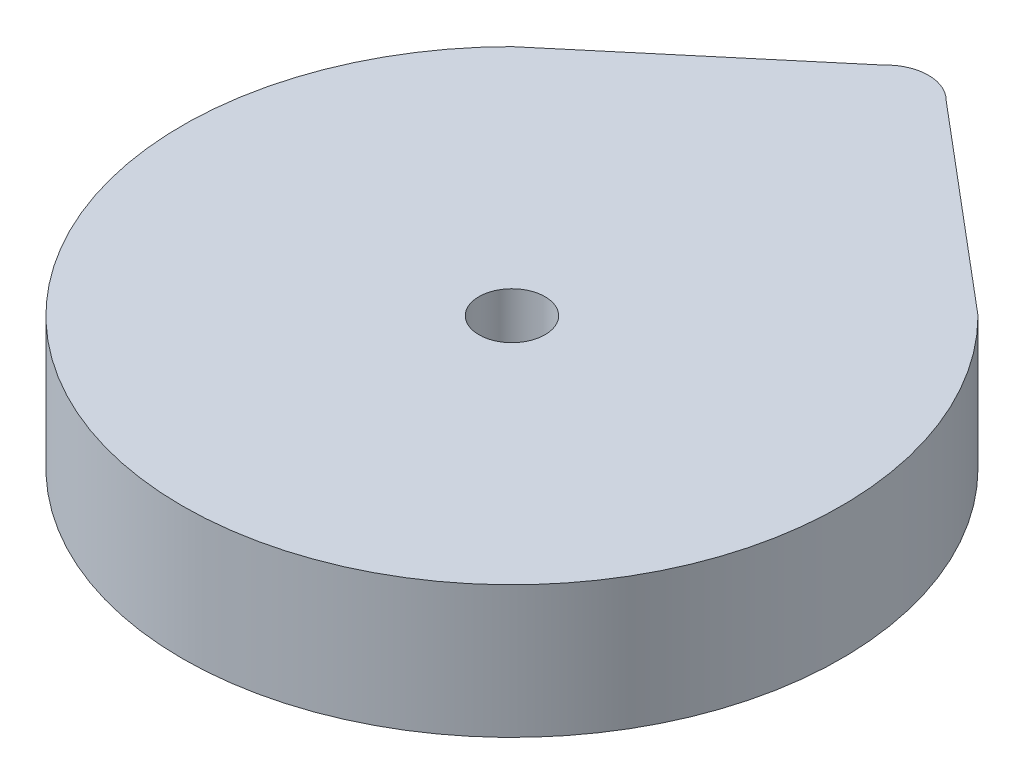
ISO-10303-21;
HEADER;
FILE_DESCRIPTION(('STEP AP214'),'2;1');
FILE_NAME('part.step','',(''),(''),'','','');
FILE_SCHEMA(('AUTOMOTIVE_DESIGN { 1 0 10303 214 1 1 1 1 }'));
ENDSEC;
DATA;
#1=APPLICATION_CONTEXT('core data for automotive mechanical design processes');
#2=APPLICATION_PROTOCOL_DEFINITION('international standard','automotive_design',2000,#1);
#3=PRODUCT_CONTEXT('',#1,'mechanical');
#4=PRODUCT('Part','Part','',(#3));
#5=PRODUCT_RELATED_PRODUCT_CATEGORY('part','',(#4));
#6=PRODUCT_DEFINITION_FORMATION('','',#4);
#7=PRODUCT_DEFINITION_CONTEXT('part definition',#1,'design');
#8=PRODUCT_DEFINITION('design','',#6,#7);
#9=PRODUCT_DEFINITION_SHAPE('','',#8);
#10=(LENGTH_UNIT() NAMED_UNIT(*) SI_UNIT(.MILLI.,.METRE.));
#11=(NAMED_UNIT(*) PLANE_ANGLE_UNIT() SI_UNIT($,.RADIAN.));
#12=(NAMED_UNIT(*) SI_UNIT($,.STERADIAN.) SOLID_ANGLE_UNIT());
#13=UNCERTAINTY_MEASURE_WITH_UNIT(LENGTH_MEASURE(1.E-05),#10,'distance_accuracy_value','');
#14=(GEOMETRIC_REPRESENTATION_CONTEXT(3) GLOBAL_UNCERTAINTY_ASSIGNED_CONTEXT((#13)) GLOBAL_UNIT_ASSIGNED_CONTEXT((#10,
#11,#12)) REPRESENTATION_CONTEXT('',''));
#15=CARTESIAN_POINT('',(0.,0.,0.));
#16=DIRECTION('',(0.,0.,1.));
#17=DIRECTION('',(1.,0.,0.));
#18=AXIS2_PLACEMENT_3D('',#15,#16,#17);
#19=CARTESIAN_POINT('',(0.,5.08,-14.3662420125912));
#20=DIRECTION('',(0.,1.,0.));
#21=DIRECTION('',(0.,0.,1.));
#22=AXIS2_PLACEMENT_3D('',#19,#20,#21);
#23=PLANE('',#22);
#24=DIRECTION('',(-0.764735589816638,0.,-0.644344222964557));
#25=VECTOR('',#24,1.);
#26=CARTESIAN_POINT('',(8.953988523824,5.08,-8.95398852382403));
#27=LINE('',#26,#25);
#28=CARTESIAN_POINT('',(8.95398852382399,5.08,-8.95398852382404));
#29=VERTEX_POINT('',#28);
#30=CARTESIAN_POINT('',(1.17354275739454,5.08,-15.5095684503316));
#31=VERTEX_POINT('',#30);
#32=EDGE_CURVE('E103',#29,#31,#27,.T.);
#33=ORIENTED_EDGE('',*,*,#32,.T.);
#34=CARTESIAN_POINT('',(0.,5.08,-14.3662420125912));
#35=DIRECTION('',(0.,1.,0.));
#36=DIRECTION('',(0.,0.,1.));
#37=AXIS2_PLACEMENT_3D('',#34,#35,#36);
#38=CIRCLE('',#37,1.63841324050719);
#39=CARTESIAN_POINT('',(-1.20832673642565,5.08,-15.4727430043251));
#40=VERTEX_POINT('',#39);
#41=EDGE_CURVE('E98',#31,#40,#38,.T.);
#42=ORIENTED_EDGE('',*,*,#41,.T.);
#43=DIRECTION('',(0.765101365427687,0.,-0.643909854421168));
#44=VECTOR('',#43,1.);
#45=CARTESIAN_POINT('',(-8.95398852382406,5.08,-8.95398852382397));
#46=LINE('',#45,#44);
#47=CARTESIAN_POINT('',(-8.95398852382406,5.08,-8.95398852382397));
#48=VERTEX_POINT('',#47);
#49=EDGE_CURVE('E101',#48,#40,#46,.T.);
#50=ORIENTED_EDGE('',*,*,#49,.F.);
#51=CARTESIAN_POINT('',(0.,5.08,0.));
#52=DIRECTION('',(0.,1.,0.));
#53=DIRECTION('',(0.,0.,1.));
#54=AXIS2_PLACEMENT_3D('',#51,#52,#53);
#55=CIRCLE('',#54,12.662852007725);
#56=EDGE_CURVE('E72',#48,#29,#55,.T.);
#57=ORIENTED_EDGE('',*,*,#56,.T.);
#58=EDGE_LOOP('',(#33,#42,#50,#57));
#59=FACE_BOUND('',#58,.T.);
#60=CARTESIAN_POINT('',(0.,5.08,0.));
#61=DIRECTION('',(0.,1.,0.));
#62=DIRECTION('',(0.,0.,1.));
#63=AXIS2_PLACEMENT_3D('',#60,#61,#62);
#64=CIRCLE('',#63,1.27);
#65=CARTESIAN_POINT('',(0.,5.08,1.27));
#66=VERTEX_POINT('',#65);
#67=EDGE_CURVE('E126',#66,#66,#64,.T.);
#68=ORIENTED_EDGE('',*,*,#67,.F.);
#69=EDGE_LOOP('',(#68));
#70=FACE_BOUND('',#69,.T.);
#71=ADVANCED_FACE('F54',(#59,#70),#23,.T.);
#72=CARTESIAN_POINT('',(0.,0.,-14.3662420125912));
#73=DIRECTION('',(0.,1.,0.));
#74=DIRECTION('',(0.,0.,1.));
#75=AXIS2_PLACEMENT_3D('',#72,#73,#74);
#76=PLANE('',#75);
#77=DIRECTION('',(-0.764735589816638,0.,-0.644344222964557));
#78=VECTOR('',#77,1.);
#79=CARTESIAN_POINT('',(8.953988523824,0.,-8.95398852382403));
#80=LINE('',#79,#78);
#81=CARTESIAN_POINT('',(8.95398852382399,0.,-8.95398852382404));
#82=VERTEX_POINT('',#81);
#83=CARTESIAN_POINT('',(1.17354275739454,0.,-15.5095684503316));
#84=VERTEX_POINT('',#83);
#85=EDGE_CURVE('E122',#82,#84,#80,.T.);
#86=ORIENTED_EDGE('',*,*,#85,.F.);
#87=CARTESIAN_POINT('',(0.,0.,0.));
#88=DIRECTION('',(0.,1.,0.));
#89=DIRECTION('',(0.,0.,1.));
#90=AXIS2_PLACEMENT_3D('',#87,#88,#89);
#91=CIRCLE('',#90,12.662852007725);
#92=CARTESIAN_POINT('',(-8.95398852382406,0.,-8.95398852382397));
#93=VERTEX_POINT('',#92);
#94=EDGE_CURVE('E91',#93,#82,#91,.T.);
#95=ORIENTED_EDGE('',*,*,#94,.F.);
#96=DIRECTION('',(0.765101365427687,0.,-0.643909854421168));
#97=VECTOR('',#96,1.);
#98=CARTESIAN_POINT('',(-8.95398852382406,0.,-8.95398852382397));
#99=LINE('',#98,#97);
#100=CARTESIAN_POINT('',(-1.20832673642565,0.,-15.4727430043251));
#101=VERTEX_POINT('',#100);
#102=EDGE_CURVE('E129',#93,#101,#99,.T.);
#103=ORIENTED_EDGE('',*,*,#102,.T.);
#104=CARTESIAN_POINT('',(0.,0.,-14.3662420125912));
#105=DIRECTION('',(0.,1.,0.));
#106=DIRECTION('',(0.,0.,1.));
#107=AXIS2_PLACEMENT_3D('',#104,#105,#106);
#108=CIRCLE('',#107,1.63841324050719);
#109=EDGE_CURVE('E109',#84,#101,#108,.T.);
#110=ORIENTED_EDGE('',*,*,#109,.F.);
#111=EDGE_LOOP('',(#86,#95,#103,#110));
#112=FACE_BOUND('',#111,.T.);
#113=CARTESIAN_POINT('',(0.,0.,0.));
#114=DIRECTION('',(0.,1.,0.));
#115=DIRECTION('',(0.,0.,1.));
#116=AXIS2_PLACEMENT_3D('',#113,#114,#115);
#117=CIRCLE('',#116,1.27);
#118=CARTESIAN_POINT('',(0.,0.,1.27));
#119=VERTEX_POINT('',#118);
#120=EDGE_CURVE('E146',#119,#119,#117,.T.);
#121=ORIENTED_EDGE('',*,*,#120,.T.);
#122=EDGE_LOOP('',(#121));
#123=FACE_BOUND('',#122,.T.);
#124=ADVANCED_FACE('F140',(#112,#123),#76,.F.);
#125=CARTESIAN_POINT('',(8.953988523824,5.08,-8.95398852382403));
#126=DIRECTION('',(-0.644344222964557,0.,0.764735589816638));
#127=DIRECTION('',(0.764735589816638,0.,0.644344222964557));
#128=AXIS2_PLACEMENT_3D('',#125,#126,#127);
#129=PLANE('',#128);
#130=ORIENTED_EDGE('',*,*,#85,.T.);
#131=DIRECTION('',(0.,-1.,0.));
#132=VECTOR('',#131,1.);
#133=CARTESIAN_POINT('',(1.17354275739454,5.08,-15.5095684503316));
#134=LINE('',#133,#132);
#135=EDGE_CURVE('E12',#31,#84,#134,.T.);
#136=ORIENTED_EDGE('',*,*,#135,.F.);
#137=ORIENTED_EDGE('',*,*,#32,.F.);
#138=DIRECTION('',(0.,-1.,0.));
#139=VECTOR('',#138,1.);
#140=CARTESIAN_POINT('',(8.95398852382399,5.08,-8.95398852382404));
#141=LINE('',#140,#139);
#142=EDGE_CURVE('E118',#29,#82,#141,.T.);
#143=ORIENTED_EDGE('',*,*,#142,.T.);
#144=EDGE_LOOP('',(#130,#136,#137,#143));
#145=FACE_BOUND('',#144,.T.);
#146=ADVANCED_FACE('F56',(#145),#129,.F.);
#147=CARTESIAN_POINT('',(0.,5.08,-14.3662420125912));
#148=DIRECTION('',(0.,-1.,0.));
#149=DIRECTION('',(0.,0.,-1.));
#150=AXIS2_PLACEMENT_3D('',#147,#148,#149);
#151=CYLINDRICAL_SURFACE('',#150,1.63841324050719);
#152=ORIENTED_EDGE('',*,*,#109,.T.);
#153=DIRECTION('',(0.,-1.,0.));
#154=VECTOR('',#153,1.);
#155=CARTESIAN_POINT('',(-1.20832673642565,5.08,-15.4727430043251));
#156=LINE('',#155,#154);
#157=EDGE_CURVE('E64',#40,#101,#156,.T.);
#158=ORIENTED_EDGE('',*,*,#157,.F.);
#159=ORIENTED_EDGE('',*,*,#41,.F.);
#160=ORIENTED_EDGE('',*,*,#135,.T.);
#161=EDGE_LOOP('',(#152,#158,#159,#160));
#162=FACE_BOUND('',#161,.T.);
#163=ADVANCED_FACE('F108',(#162),#151,.T.);
#164=CARTESIAN_POINT('',(-8.95398852382406,5.08,-8.95398852382397));
#165=DIRECTION('',(-0.643909854421167,0.,-0.765101365427687));
#166=DIRECTION('',(-0.765101365427687,0.,0.643909854421167));
#167=AXIS2_PLACEMENT_3D('',#164,#165,#166);
#168=PLANE('',#167);
#169=ORIENTED_EDGE('',*,*,#102,.F.);
#170=DIRECTION('',(0.,-1.,0.));
#171=VECTOR('',#170,1.);
#172=CARTESIAN_POINT('',(-8.95398852382406,5.08,-8.95398852382397));
#173=LINE('',#172,#171);
#174=EDGE_CURVE('E88',#48,#93,#173,.T.);
#175=ORIENTED_EDGE('',*,*,#174,.F.);
#176=ORIENTED_EDGE('',*,*,#49,.T.);
#177=ORIENTED_EDGE('',*,*,#157,.T.);
#178=EDGE_LOOP('',(#169,#175,#176,#177));
#179=FACE_BOUND('',#178,.T.);
#180=ADVANCED_FACE('F114',(#179),#168,.T.);
#181=CARTESIAN_POINT('',(0.,5.08,0.));
#182=DIRECTION('',(0.,-1.,0.));
#183=DIRECTION('',(0.,0.,-1.));
#184=AXIS2_PLACEMENT_3D('',#181,#182,#183);
#185=CYLINDRICAL_SURFACE('',#184,12.662852007725);
#186=ORIENTED_EDGE('',*,*,#94,.T.);
#187=ORIENTED_EDGE('',*,*,#142,.F.);
#188=ORIENTED_EDGE('',*,*,#56,.F.);
#189=ORIENTED_EDGE('',*,*,#174,.T.);
#190=EDGE_LOOP('',(#186,#187,#188,#189));
#191=FACE_BOUND('',#190,.T.);
#192=ADVANCED_FACE('F163',(#191),#185,.T.);
#193=CARTESIAN_POINT('',(0.,5.08,0.));
#194=DIRECTION('',(0.,-1.,0.));
#195=DIRECTION('',(0.,0.,-1.));
#196=AXIS2_PLACEMENT_3D('',#193,#194,#195);
#197=CYLINDRICAL_SURFACE('',#196,1.27);
#198=ORIENTED_EDGE('',*,*,#67,.T.);
#199=EDGE_LOOP('',(#198));
#200=FACE_BOUND('',#199,.T.);
#201=ORIENTED_EDGE('',*,*,#120,.F.);
#202=EDGE_LOOP('',(#201));
#203=FACE_BOUND('',#202,.T.);
#204=ADVANCED_FACE('F156',(#200,#203),#197,.F.);
#205=CLOSED_SHELL('',(#71,#124,#146,#163,#180,#192,#204));
#206=MANIFOLD_SOLID_BREP('B2',#205);
#207=ADVANCED_BREP_SHAPE_REPRESENTATION('',(#18,#206),#14);
#208=SHAPE_DEFINITION_REPRESENTATION(#9,#207);
ENDSEC;
END-ISO-10303-21;
